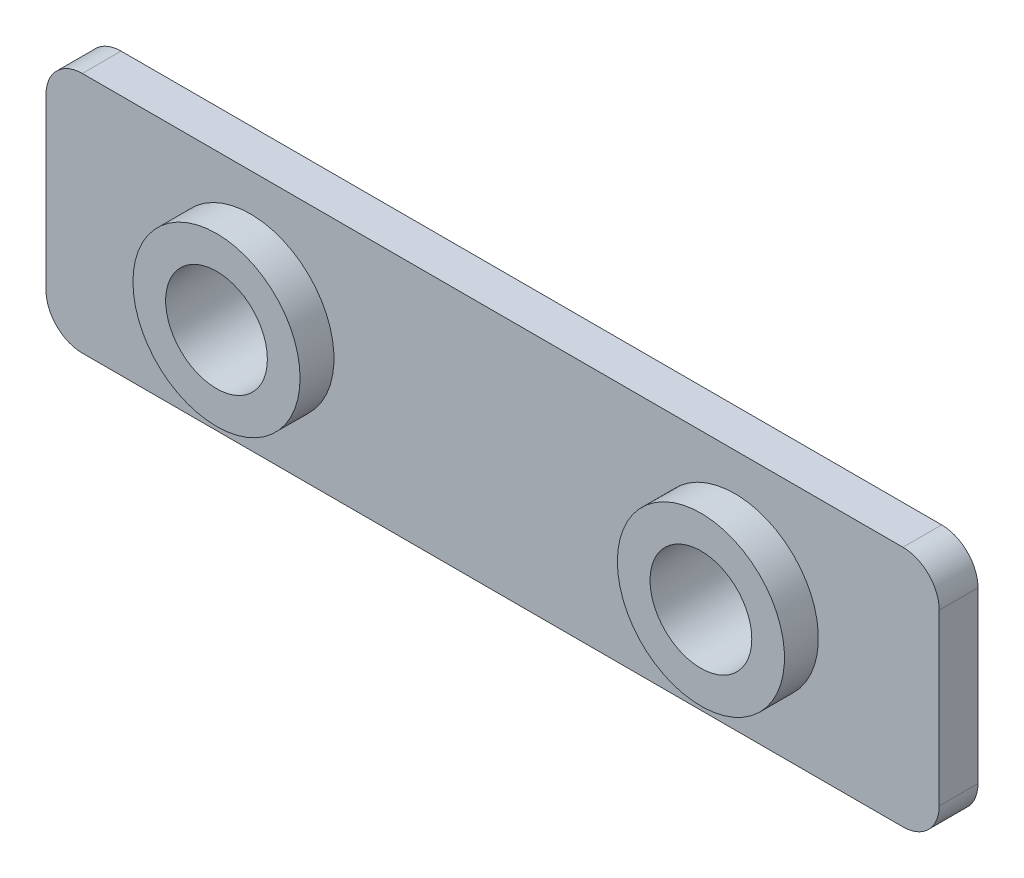
ISO-10303-21;
HEADER;
FILE_DESCRIPTION(('STEP AP214'),'2;1');
FILE_NAME('part.step','',(''),(''),'','','');
FILE_SCHEMA(('AUTOMOTIVE_DESIGN { 1 0 10303 214 1 1 1 1 }'));
ENDSEC;
DATA;
#1=APPLICATION_CONTEXT('core data for automotive mechanical design processes');
#2=APPLICATION_PROTOCOL_DEFINITION('international standard','automotive_design',2000,#1);
#3=PRODUCT_CONTEXT('',#1,'mechanical');
#4=PRODUCT('Part','Part','',(#3));
#5=PRODUCT_RELATED_PRODUCT_CATEGORY('part','',(#4));
#6=PRODUCT_DEFINITION_FORMATION('','',#4);
#7=PRODUCT_DEFINITION_CONTEXT('part definition',#1,'design');
#8=PRODUCT_DEFINITION('design','',#6,#7);
#9=PRODUCT_DEFINITION_SHAPE('','',#8);
#10=(LENGTH_UNIT() NAMED_UNIT(*) SI_UNIT(.MILLI.,.METRE.));
#11=(NAMED_UNIT(*) PLANE_ANGLE_UNIT() SI_UNIT($,.RADIAN.));
#12=(NAMED_UNIT(*) SI_UNIT($,.STERADIAN.) SOLID_ANGLE_UNIT());
#13=UNCERTAINTY_MEASURE_WITH_UNIT(LENGTH_MEASURE(1.E-05),#10,'distance_accuracy_value','');
#14=(GEOMETRIC_REPRESENTATION_CONTEXT(3) GLOBAL_UNCERTAINTY_ASSIGNED_CONTEXT((#13)) GLOBAL_UNIT_ASSIGNED_CONTEXT((#10,
#11,#12)) REPRESENTATION_CONTEXT('',''));
#15=CARTESIAN_POINT('',(0.,0.,0.));
#16=DIRECTION('',(0.,0.,1.));
#17=DIRECTION('',(1.,0.,0.));
#18=AXIS2_PLACEMENT_3D('',#15,#16,#17);
#19=CARTESIAN_POINT('',(35.38,8.5,1.6));
#20=DIRECTION('',(0.,0.,-1.));
#21=DIRECTION('',(-1.,0.,0.));
#22=AXIS2_PLACEMENT_3D('',#19,#20,#21);
#23=PLANE('',#22);
#24=CARTESIAN_POINT('',(8.44,5.,1.6));
#25=DIRECTION('',(0.,0.,-1.));
#26=DIRECTION('',(-1.,0.,0.));
#27=AXIS2_PLACEMENT_3D('',#24,#25,#26);
#28=CIRCLE('',#27,3.45);
#29=CARTESIAN_POINT('',(4.99,5.,1.6));
#30=VERTEX_POINT('',#29);
#31=EDGE_CURVE('E47',#30,#30,#28,.F.);
#32=ORIENTED_EDGE('',*,*,#31,.F.);
#33=EDGE_LOOP('',(#32));
#34=FACE_BOUND('',#33,.T.);
#35=CARTESIAN_POINT('',(35.38,8.5,1.6));
#36=DIRECTION('',(0.,0.,1.));
#37=DIRECTION('',(-1.,0.,0.));
#38=AXIS2_PLACEMENT_3D('',#35,#36,#37);
#39=CIRCLE('',#38,1.5);
#40=CARTESIAN_POINT('',(36.88,8.49999999999999,1.6));
#41=VERTEX_POINT('',#40);
#42=CARTESIAN_POINT('',(35.38,10.,1.6));
#43=VERTEX_POINT('',#42);
#44=EDGE_CURVE('E151',#41,#43,#39,.T.);
#45=ORIENTED_EDGE('',*,*,#44,.T.);
#46=DIRECTION('',(-1.,0.,0.));
#47=VECTOR('',#46,1.);
#48=CARTESIAN_POINT('',(1.50000000000001,10.,1.6));
#49=LINE('',#48,#47);
#50=CARTESIAN_POINT('',(1.50000000000001,10.,1.6));
#51=VERTEX_POINT('',#50);
#52=EDGE_CURVE('E99',#43,#51,#49,.T.);
#53=ORIENTED_EDGE('',*,*,#52,.T.);
#54=CARTESIAN_POINT('',(1.5,8.5,1.6));
#55=DIRECTION('',(0.,0.,1.));
#56=DIRECTION('',(-1.,0.,0.));
#57=AXIS2_PLACEMENT_3D('',#54,#55,#56);
#58=CIRCLE('',#57,1.5);
#59=CARTESIAN_POINT('',(0.,8.49999999999999,1.6));
#60=VERTEX_POINT('',#59);
#61=EDGE_CURVE('E211',#51,#60,#58,.T.);
#62=ORIENTED_EDGE('',*,*,#61,.T.);
#63=DIRECTION('',(0.,-1.,0.));
#64=VECTOR('',#63,1.);
#65=CARTESIAN_POINT('',(0.,1.50000000000001,1.6));
#66=LINE('',#65,#64);
#67=CARTESIAN_POINT('',(0.,1.50000000000001,1.6));
#68=VERTEX_POINT('',#67);
#69=EDGE_CURVE('E216',#60,#68,#66,.T.);
#70=ORIENTED_EDGE('',*,*,#69,.T.);
#71=CARTESIAN_POINT('',(1.5,1.5,1.6));
#72=DIRECTION('',(0.,0.,1.));
#73=DIRECTION('',(-1.,0.,0.));
#74=AXIS2_PLACEMENT_3D('',#71,#72,#73);
#75=CIRCLE('',#74,1.5);
#76=CARTESIAN_POINT('',(1.50000000000001,0.,1.6));
#77=VERTEX_POINT('',#76);
#78=EDGE_CURVE('E118',#68,#77,#75,.T.);
#79=ORIENTED_EDGE('',*,*,#78,.T.);
#80=DIRECTION('',(1.,0.,0.));
#81=VECTOR('',#80,1.);
#82=CARTESIAN_POINT('',(1.50000000000001,0.,1.6));
#83=LINE('',#82,#81);
#84=CARTESIAN_POINT('',(35.38,0.,1.6));
#85=VERTEX_POINT('',#84);
#86=EDGE_CURVE('E112',#77,#85,#83,.T.);
#87=ORIENTED_EDGE('',*,*,#86,.T.);
#88=CARTESIAN_POINT('',(35.38,1.5,1.6));
#89=DIRECTION('',(0.,0.,1.));
#90=DIRECTION('',(1.,0.,0.));
#91=AXIS2_PLACEMENT_3D('',#88,#89,#90);
#92=CIRCLE('',#91,1.5);
#93=CARTESIAN_POINT('',(36.88,1.50000000000001,1.6));
#94=VERTEX_POINT('',#93);
#95=EDGE_CURVE('E116',#85,#94,#92,.T.);
#96=ORIENTED_EDGE('',*,*,#95,.T.);
#97=DIRECTION('',(0.,1.,0.));
#98=VECTOR('',#97,1.);
#99=CARTESIAN_POINT('',(36.88,1.50000000000001,1.6));
#100=LINE('',#99,#98);
#101=EDGE_CURVE('E55',#94,#41,#100,.T.);
#102=ORIENTED_EDGE('',*,*,#101,.T.);
#103=EDGE_LOOP('',(#45,#53,#62,#70,#79,#87,#96,#102));
#104=FACE_BOUND('',#103,.T.);
#105=CARTESIAN_POINT('',(28.44,5.,1.6));
#106=DIRECTION('',(0.,0.,-1.));
#107=DIRECTION('',(-1.,0.,0.));
#108=AXIS2_PLACEMENT_3D('',#105,#106,#107);
#109=CIRCLE('',#108,3.45);
#110=CARTESIAN_POINT('',(24.99,5.,1.6));
#111=VERTEX_POINT('',#110);
#112=EDGE_CURVE('E11',#111,#111,#109,.F.);
#113=ORIENTED_EDGE('',*,*,#112,.F.);
#114=EDGE_LOOP('',(#113));
#115=FACE_BOUND('',#114,.T.);
#116=ADVANCED_FACE('F38',(#34,#104,#115),#23,.F.);
#117=CARTESIAN_POINT('',(35.38,8.5,1.6));
#118=DIRECTION('',(0.,0.,-1.));
#119=DIRECTION('',(-1.,0.,0.));
#120=AXIS2_PLACEMENT_3D('',#117,#118,#119);
#121=CYLINDRICAL_SURFACE('',#120,1.5);
#122=CARTESIAN_POINT('',(35.38,8.5,0.));
#123=DIRECTION('',(0.,0.,1.));
#124=DIRECTION('',(-1.,0.,0.));
#125=AXIS2_PLACEMENT_3D('',#122,#123,#124);
#126=CIRCLE('',#125,1.5);
#127=CARTESIAN_POINT('',(36.88,8.49999999999999,0.));
#128=VERTEX_POINT('',#127);
#129=CARTESIAN_POINT('',(35.38,10.,0.));
#130=VERTEX_POINT('',#129);
#131=EDGE_CURVE('E136',#128,#130,#126,.T.);
#132=ORIENTED_EDGE('',*,*,#131,.T.);
#133=DIRECTION('',(0.,0.,-1.));
#134=VECTOR('',#133,1.);
#135=CARTESIAN_POINT('',(35.38,10.,1.6));
#136=LINE('',#135,#134);
#137=EDGE_CURVE('E164',#43,#130,#136,.T.);
#138=ORIENTED_EDGE('',*,*,#137,.F.);
#139=ORIENTED_EDGE('',*,*,#44,.F.);
#140=DIRECTION('',(0.,0.,-1.));
#141=VECTOR('',#140,1.);
#142=CARTESIAN_POINT('',(36.88,8.49999999999999,1.6));
#143=LINE('',#142,#141);
#144=EDGE_CURVE('E132',#41,#128,#143,.T.);
#145=ORIENTED_EDGE('',*,*,#144,.T.);
#146=EDGE_LOOP('',(#132,#138,#139,#145));
#147=FACE_BOUND('',#146,.T.);
#148=ADVANCED_FACE('F40',(#147),#121,.T.);
#149=CARTESIAN_POINT('',(1.50000000000001,10.,1.6));
#150=DIRECTION('',(0.,-1.,0.));
#151=DIRECTION('',(0.,0.,-1.));
#152=AXIS2_PLACEMENT_3D('',#149,#150,#151);
#153=PLANE('',#152);
#154=DIRECTION('',(-1.,0.,0.));
#155=VECTOR('',#154,1.);
#156=CARTESIAN_POINT('',(1.50000000000001,10.,0.));
#157=LINE('',#156,#155);
#158=CARTESIAN_POINT('',(1.50000000000001,10.,0.));
#159=VERTEX_POINT('',#158);
#160=EDGE_CURVE('E139',#130,#159,#157,.T.);
#161=ORIENTED_EDGE('',*,*,#160,.T.);
#162=DIRECTION('',(0.,0.,-1.));
#163=VECTOR('',#162,1.);
#164=CARTESIAN_POINT('',(1.50000000000001,10.,1.6));
#165=LINE('',#164,#163);
#166=EDGE_CURVE('E161',#51,#159,#165,.T.);
#167=ORIENTED_EDGE('',*,*,#166,.F.);
#168=ORIENTED_EDGE('',*,*,#52,.F.);
#169=ORIENTED_EDGE('',*,*,#137,.T.);
#170=EDGE_LOOP('',(#161,#167,#168,#169));
#171=FACE_BOUND('',#170,.T.);
#172=ADVANCED_FACE('F175',(#171),#153,.F.);
#173=CARTESIAN_POINT('',(1.5,8.5,1.6));
#174=DIRECTION('',(0.,0.,-1.));
#175=DIRECTION('',(-1.,0.,0.));
#176=AXIS2_PLACEMENT_3D('',#173,#174,#175);
#177=CYLINDRICAL_SURFACE('',#176,1.5);
#178=CARTESIAN_POINT('',(1.5,8.5,0.));
#179=DIRECTION('',(0.,0.,1.));
#180=DIRECTION('',(-1.,0.,0.));
#181=AXIS2_PLACEMENT_3D('',#178,#179,#180);
#182=CIRCLE('',#181,1.5);
#183=CARTESIAN_POINT('',(0.,8.49999999999999,0.));
#184=VERTEX_POINT('',#183);
#185=EDGE_CURVE('E142',#159,#184,#182,.T.);
#186=ORIENTED_EDGE('',*,*,#185,.T.);
#187=DIRECTION('',(0.,0.,-1.));
#188=VECTOR('',#187,1.);
#189=CARTESIAN_POINT('',(0.,8.49999999999999,1.6));
#190=LINE('',#189,#188);
#191=EDGE_CURVE('E158',#60,#184,#190,.T.);
#192=ORIENTED_EDGE('',*,*,#191,.F.);
#193=ORIENTED_EDGE('',*,*,#61,.F.);
#194=ORIENTED_EDGE('',*,*,#166,.T.);
#195=EDGE_LOOP('',(#186,#192,#193,#194));
#196=FACE_BOUND('',#195,.T.);
#197=ADVANCED_FACE('F198',(#196),#177,.T.);
#198=CARTESIAN_POINT('',(0.,1.50000000000001,1.6));
#199=DIRECTION('',(1.,0.,0.));
#200=DIRECTION('',(0.,0.,-1.));
#201=AXIS2_PLACEMENT_3D('',#198,#199,#200);
#202=PLANE('',#201);
#203=DIRECTION('',(0.,-1.,0.));
#204=VECTOR('',#203,1.);
#205=CARTESIAN_POINT('',(0.,1.50000000000001,0.));
#206=LINE('',#205,#204);
#207=CARTESIAN_POINT('',(0.,1.50000000000001,0.));
#208=VERTEX_POINT('',#207);
#209=EDGE_CURVE('E144',#184,#208,#206,.T.);
#210=ORIENTED_EDGE('',*,*,#209,.T.);
#211=DIRECTION('',(0.,0.,-1.));
#212=VECTOR('',#211,1.);
#213=CARTESIAN_POINT('',(0.,1.50000000000001,1.6));
#214=LINE('',#213,#212);
#215=EDGE_CURVE('E155',#68,#208,#214,.T.);
#216=ORIENTED_EDGE('',*,*,#215,.F.);
#217=ORIENTED_EDGE('',*,*,#69,.F.);
#218=ORIENTED_EDGE('',*,*,#191,.T.);
#219=EDGE_LOOP('',(#210,#216,#217,#218));
#220=FACE_BOUND('',#219,.T.);
#221=ADVANCED_FACE('F194',(#220),#202,.F.);
#222=CARTESIAN_POINT('',(1.5,1.5,1.6));
#223=DIRECTION('',(0.,0.,-1.));
#224=DIRECTION('',(-1.,0.,0.));
#225=AXIS2_PLACEMENT_3D('',#222,#223,#224);
#226=CYLINDRICAL_SURFACE('',#225,1.5);
#227=CARTESIAN_POINT('',(1.5,1.5,0.));
#228=DIRECTION('',(0.,0.,1.));
#229=DIRECTION('',(-1.,0.,0.));
#230=AXIS2_PLACEMENT_3D('',#227,#228,#229);
#231=CIRCLE('',#230,1.5);
#232=CARTESIAN_POINT('',(1.50000000000001,0.,0.));
#233=VERTEX_POINT('',#232);
#234=EDGE_CURVE('E146',#208,#233,#231,.T.);
#235=ORIENTED_EDGE('',*,*,#234,.T.);
#236=DIRECTION('',(0.,0.,-1.));
#237=VECTOR('',#236,1.);
#238=CARTESIAN_POINT('',(1.50000000000001,0.,1.6));
#239=LINE('',#238,#237);
#240=EDGE_CURVE('E127',#77,#233,#239,.T.);
#241=ORIENTED_EDGE('',*,*,#240,.F.);
#242=ORIENTED_EDGE('',*,*,#78,.F.);
#243=ORIENTED_EDGE('',*,*,#215,.T.);
#244=EDGE_LOOP('',(#235,#241,#242,#243));
#245=FACE_BOUND('',#244,.T.);
#246=ADVANCED_FACE('F191',(#245),#226,.T.);
#247=CARTESIAN_POINT('',(1.50000000000001,0.,1.6));
#248=DIRECTION('',(0.,1.,0.));
#249=DIRECTION('',(0.,0.,1.));
#250=AXIS2_PLACEMENT_3D('',#247,#248,#249);
#251=PLANE('',#250);
#252=DIRECTION('',(1.,0.,0.));
#253=VECTOR('',#252,1.);
#254=CARTESIAN_POINT('',(1.50000000000001,0.,0.));
#255=LINE('',#254,#253);
#256=CARTESIAN_POINT('',(35.38,0.,0.));
#257=VERTEX_POINT('',#256);
#258=EDGE_CURVE('E126',#233,#257,#255,.T.);
#259=ORIENTED_EDGE('',*,*,#258,.T.);
#260=DIRECTION('',(0.,0.,-1.));
#261=VECTOR('',#260,1.);
#262=CARTESIAN_POINT('',(35.38,0.,1.6));
#263=LINE('',#262,#261);
#264=EDGE_CURVE('E123',#85,#257,#263,.T.);
#265=ORIENTED_EDGE('',*,*,#264,.F.);
#266=ORIENTED_EDGE('',*,*,#86,.F.);
#267=ORIENTED_EDGE('',*,*,#240,.T.);
#268=EDGE_LOOP('',(#259,#265,#266,#267));
#269=FACE_BOUND('',#268,.T.);
#270=ADVANCED_FACE('F124',(#269),#251,.F.);
#271=CARTESIAN_POINT('',(35.38,1.5,1.6));
#272=DIRECTION('',(0.,0.,-1.));
#273=DIRECTION('',(-1.,0.,0.));
#274=AXIS2_PLACEMENT_3D('',#271,#272,#273);
#275=CYLINDRICAL_SURFACE('',#274,1.5);
#276=CARTESIAN_POINT('',(35.38,1.5,0.));
#277=DIRECTION('',(0.,0.,1.));
#278=DIRECTION('',(1.,0.,0.));
#279=AXIS2_PLACEMENT_3D('',#276,#277,#278);
#280=CIRCLE('',#279,1.5);
#281=CARTESIAN_POINT('',(36.88,1.50000000000001,0.));
#282=VERTEX_POINT('',#281);
#283=EDGE_CURVE('E84',#257,#282,#280,.T.);
#284=ORIENTED_EDGE('',*,*,#283,.T.);
#285=DIRECTION('',(0.,0.,-1.));
#286=VECTOR('',#285,1.);
#287=CARTESIAN_POINT('',(36.88,1.50000000000001,1.6));
#288=LINE('',#287,#286);
#289=EDGE_CURVE('E128',#94,#282,#288,.T.);
#290=ORIENTED_EDGE('',*,*,#289,.F.);
#291=ORIENTED_EDGE('',*,*,#95,.F.);
#292=ORIENTED_EDGE('',*,*,#264,.T.);
#293=EDGE_LOOP('',(#284,#290,#291,#292));
#294=FACE_BOUND('',#293,.T.);
#295=ADVANCED_FACE('F130',(#294),#275,.T.);
#296=CARTESIAN_POINT('',(36.88,1.50000000000001,1.6));
#297=DIRECTION('',(-1.,0.,0.));
#298=DIRECTION('',(0.,0.,1.));
#299=AXIS2_PLACEMENT_3D('',#296,#297,#298);
#300=PLANE('',#299);
#301=DIRECTION('',(0.,1.,0.));
#302=VECTOR('',#301,1.);
#303=CARTESIAN_POINT('',(36.88,1.50000000000001,0.));
#304=LINE('',#303,#302);
#305=EDGE_CURVE('E90',#282,#128,#304,.T.);
#306=ORIENTED_EDGE('',*,*,#305,.T.);
#307=ORIENTED_EDGE('',*,*,#144,.F.);
#308=ORIENTED_EDGE('',*,*,#101,.F.);
#309=ORIENTED_EDGE('',*,*,#289,.T.);
#310=EDGE_LOOP('',(#306,#307,#308,#309));
#311=FACE_BOUND('',#310,.T.);
#312=ADVANCED_FACE('F183',(#311),#300,.F.);
#313=CARTESIAN_POINT('',(35.38,8.5,0.));
#314=DIRECTION('',(0.,0.,-1.));
#315=DIRECTION('',(-1.,0.,0.));
#316=AXIS2_PLACEMENT_3D('',#313,#314,#315);
#317=PLANE('',#316);
#318=CARTESIAN_POINT('',(8.44,5.,0.));
#319=DIRECTION('',(0.,0.,1.));
#320=DIRECTION('',(1.,0.,0.));
#321=AXIS2_PLACEMENT_3D('',#318,#319,#320);
#322=CIRCLE('',#321,2.1);
#323=CARTESIAN_POINT('',(10.54,5.,0.));
#324=VERTEX_POINT('',#323);
#325=EDGE_CURVE('E233',#324,#324,#322,.T.);
#326=ORIENTED_EDGE('',*,*,#325,.T.);
#327=EDGE_LOOP('',(#326));
#328=FACE_BOUND('',#327,.T.);
#329=CARTESIAN_POINT('',(28.44,5.,0.));
#330=DIRECTION('',(0.,0.,1.));
#331=DIRECTION('',(1.,0.,0.));
#332=AXIS2_PLACEMENT_3D('',#329,#330,#331);
#333=CIRCLE('',#332,2.1);
#334=CARTESIAN_POINT('',(30.54,5.,0.));
#335=VERTEX_POINT('',#334);
#336=EDGE_CURVE('E227',#335,#335,#333,.T.);
#337=ORIENTED_EDGE('',*,*,#336,.T.);
#338=EDGE_LOOP('',(#337));
#339=FACE_BOUND('',#338,.T.);
#340=ORIENTED_EDGE('',*,*,#131,.F.);
#341=ORIENTED_EDGE('',*,*,#305,.F.);
#342=ORIENTED_EDGE('',*,*,#283,.F.);
#343=ORIENTED_EDGE('',*,*,#258,.F.);
#344=ORIENTED_EDGE('',*,*,#234,.F.);
#345=ORIENTED_EDGE('',*,*,#209,.F.);
#346=ORIENTED_EDGE('',*,*,#185,.F.);
#347=ORIENTED_EDGE('',*,*,#160,.F.);
#348=EDGE_LOOP('',(#340,#341,#342,#343,#344,#345,#346,#347));
#349=FACE_BOUND('',#348,.T.);
#350=ADVANCED_FACE('F180',(#328,#339,#349),#317,.T.);
#351=CARTESIAN_POINT('',(8.44,5.,3.));
#352=DIRECTION('',(0.,0.,-1.));
#353=DIRECTION('',(-1.,0.,0.));
#354=AXIS2_PLACEMENT_3D('',#351,#352,#353);
#355=CYLINDRICAL_SURFACE('',#354,3.45);
#356=CARTESIAN_POINT('',(8.44,5.,3.));
#357=DIRECTION('',(0.,0.,1.));
#358=DIRECTION('',(1.,0.,0.));
#359=AXIS2_PLACEMENT_3D('',#356,#357,#358);
#360=CIRCLE('',#359,3.45);
#361=CARTESIAN_POINT('',(11.89,5.,3.));
#362=VERTEX_POINT('',#361);
#363=EDGE_CURVE('E140',#362,#362,#360,.T.);
#364=ORIENTED_EDGE('',*,*,#363,.F.);
#365=EDGE_LOOP('',(#364));
#366=FACE_BOUND('',#365,.T.);
#367=ORIENTED_EDGE('',*,*,#31,.T.);
#368=EDGE_LOOP('',(#367));
#369=FACE_BOUND('',#368,.T.);
#370=ADVANCED_FACE('F168',(#366,#369),#355,.T.);
#371=CARTESIAN_POINT('',(8.44,5.,3.));
#372=DIRECTION('',(0.,0.,1.));
#373=DIRECTION('',(1.,0.,0.));
#374=AXIS2_PLACEMENT_3D('',#371,#372,#373);
#375=PLANE('',#374);
#376=CARTESIAN_POINT('',(8.44,5.,3.));
#377=DIRECTION('',(0.,0.,1.));
#378=DIRECTION('',(1.,0.,0.));
#379=AXIS2_PLACEMENT_3D('',#376,#377,#378);
#380=CIRCLE('',#379,2.09999999999999);
#381=CARTESIAN_POINT('',(10.54,5.,3.));
#382=VERTEX_POINT('',#381);
#383=EDGE_CURVE('E236',#382,#382,#380,.T.);
#384=ORIENTED_EDGE('',*,*,#383,.F.);
#385=EDGE_LOOP('',(#384));
#386=FACE_BOUND('',#385,.T.);
#387=ORIENTED_EDGE('',*,*,#363,.T.);
#388=EDGE_LOOP('',(#387));
#389=FACE_BOUND('',#388,.T.);
#390=ADVANCED_FACE('F242',(#386,#389),#375,.T.);
#391=CARTESIAN_POINT('',(28.44,5.,3.));
#392=DIRECTION('',(0.,0.,-1.));
#393=DIRECTION('',(-1.,0.,0.));
#394=AXIS2_PLACEMENT_3D('',#391,#392,#393);
#395=CYLINDRICAL_SURFACE('',#394,3.45);
#396=CARTESIAN_POINT('',(28.44,5.,3.));
#397=DIRECTION('',(0.,0.,1.));
#398=DIRECTION('',(-1.,0.,0.));
#399=AXIS2_PLACEMENT_3D('',#396,#397,#398);
#400=CIRCLE('',#399,3.45);
#401=CARTESIAN_POINT('',(24.99,5.,3.));
#402=VERTEX_POINT('',#401);
#403=EDGE_CURVE('E224',#402,#402,#400,.T.);
#404=ORIENTED_EDGE('',*,*,#403,.F.);
#405=EDGE_LOOP('',(#404));
#406=FACE_BOUND('',#405,.T.);
#407=ORIENTED_EDGE('',*,*,#112,.T.);
#408=EDGE_LOOP('',(#407));
#409=FACE_BOUND('',#408,.T.);
#410=ADVANCED_FACE('F245',(#406,#409),#395,.T.);
#411=CARTESIAN_POINT('',(28.44,5.,3.));
#412=DIRECTION('',(0.,0.,-1.));
#413=DIRECTION('',(-1.,0.,0.));
#414=AXIS2_PLACEMENT_3D('',#411,#412,#413);
#415=PLANE('',#414);
#416=CARTESIAN_POINT('',(28.44,5.,3.));
#417=DIRECTION('',(0.,0.,1.));
#418=DIRECTION('',(1.,0.,0.));
#419=AXIS2_PLACEMENT_3D('',#416,#417,#418);
#420=CIRCLE('',#419,2.09999999999999);
#421=CARTESIAN_POINT('',(30.54,5.,3.));
#422=VERTEX_POINT('',#421);
#423=EDGE_CURVE('E230',#422,#422,#420,.T.);
#424=ORIENTED_EDGE('',*,*,#423,.F.);
#425=EDGE_LOOP('',(#424));
#426=FACE_BOUND('',#425,.T.);
#427=ORIENTED_EDGE('',*,*,#403,.T.);
#428=EDGE_LOOP('',(#427));
#429=FACE_BOUND('',#428,.T.);
#430=ADVANCED_FACE('F263',(#426,#429),#415,.F.);
#431=CARTESIAN_POINT('',(28.44,5.,3.));
#432=DIRECTION('',(0.,0.,1.));
#433=DIRECTION('',(1.,0.,0.));
#434=AXIS2_PLACEMENT_3D('',#431,#432,#433);
#435=CYLINDRICAL_SURFACE('',#434,2.09999999999999);
#436=ORIENTED_EDGE('',*,*,#336,.F.);
#437=EDGE_LOOP('',(#436));
#438=FACE_BOUND('',#437,.T.);
#439=ORIENTED_EDGE('',*,*,#423,.T.);
#440=EDGE_LOOP('',(#439));
#441=FACE_BOUND('',#440,.T.);
#442=ADVANCED_FACE('F271',(#438,#441),#435,.F.);
#443=CARTESIAN_POINT('',(8.44,5.,3.));
#444=DIRECTION('',(0.,0.,1.));
#445=DIRECTION('',(1.,0.,0.));
#446=AXIS2_PLACEMENT_3D('',#443,#444,#445);
#447=CYLINDRICAL_SURFACE('',#446,2.09999999999999);
#448=ORIENTED_EDGE('',*,*,#325,.F.);
#449=EDGE_LOOP('',(#448));
#450=FACE_BOUND('',#449,.T.);
#451=ORIENTED_EDGE('',*,*,#383,.T.);
#452=EDGE_LOOP('',(#451));
#453=FACE_BOUND('',#452,.T.);
#454=ADVANCED_FACE('F240',(#450,#453),#447,.F.);
#455=CLOSED_SHELL('',(#116,#148,#172,#197,#221,#246,#270,#295,#312,#350,#370,#390,#410,#430,
#442,#454));
#456=MANIFOLD_SOLID_BREP('B2',#455);
#457=ADVANCED_BREP_SHAPE_REPRESENTATION('',(#18,#456),#14);
#458=SHAPE_DEFINITION_REPRESENTATION(#9,#457);
ENDSEC;
END-ISO-10303-21;
